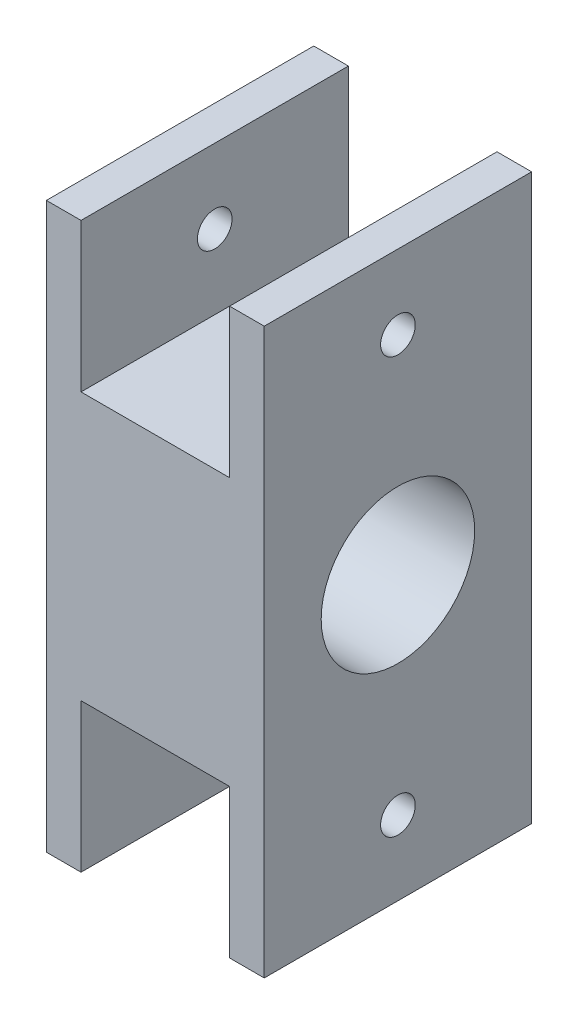
ISO-10303-21;
HEADER;
FILE_DESCRIPTION(('STEP AP214'),'2;1');
FILE_NAME('part.step','',(''),(''),'','','');
FILE_SCHEMA(('AUTOMOTIVE_DESIGN { 1 0 10303 214 1 1 1 1 }'));
ENDSEC;
DATA;
#1=APPLICATION_CONTEXT('core data for automotive mechanical design processes');
#2=APPLICATION_PROTOCOL_DEFINITION('international standard','automotive_design',2000,#1);
#3=PRODUCT_CONTEXT('',#1,'mechanical');
#4=PRODUCT('Part','Part','',(#3));
#5=PRODUCT_RELATED_PRODUCT_CATEGORY('part','',(#4));
#6=PRODUCT_DEFINITION_FORMATION('','',#4);
#7=PRODUCT_DEFINITION_CONTEXT('part definition',#1,'design');
#8=PRODUCT_DEFINITION('design','',#6,#7);
#9=PRODUCT_DEFINITION_SHAPE('','',#8);
#10=(LENGTH_UNIT() NAMED_UNIT(*) SI_UNIT(.MILLI.,.METRE.));
#11=(NAMED_UNIT(*) PLANE_ANGLE_UNIT() SI_UNIT($,.RADIAN.));
#12=(NAMED_UNIT(*) SI_UNIT($,.STERADIAN.) SOLID_ANGLE_UNIT());
#13=UNCERTAINTY_MEASURE_WITH_UNIT(LENGTH_MEASURE(1.E-05),#10,'distance_accuracy_value','');
#14=(GEOMETRIC_REPRESENTATION_CONTEXT(3) GLOBAL_UNCERTAINTY_ASSIGNED_CONTEXT((#13)) GLOBAL_UNIT_ASSIGNED_CONTEXT((#10,
#11,#12)) REPRESENTATION_CONTEXT('',''));
#15=CARTESIAN_POINT('',(0.,0.,0.));
#16=DIRECTION('',(0.,0.,1.));
#17=DIRECTION('',(1.,0.,0.));
#18=AXIS2_PLACEMENT_3D('',#15,#16,#17);
#19=CARTESIAN_POINT('',(-21.999999942,-56.999999919,53.99999995));
#20=DIRECTION('',(1.,0.,0.));
#21=DIRECTION('',(0.,0.,-1.));
#22=AXIS2_PLACEMENT_3D('',#19,#20,#21);
#23=PLANE('',#22);
#24=CARTESIAN_POINT('',(-21.999999942,0.,26.999999975));
#25=DIRECTION('',(-1.,0.,0.));
#26=DIRECTION('',(0.,0.,1.));
#27=AXIS2_PLACEMENT_3D('',#24,#25,#26);
#28=CIRCLE('',#27,20.000000005);
#29=CARTESIAN_POINT('',(-21.999999942,0.,46.99999998));
#30=VERTEX_POINT('',#29);
#31=EDGE_CURVE('E278',#30,#30,#28,.T.);
#32=ORIENTED_EDGE('',*,*,#31,.F.);
#33=EDGE_LOOP('',(#32));
#34=FACE_BOUND('',#33,.T.);
#35=CARTESIAN_POINT('',(-21.999999942,-41.999999947,26.999999975));
#36=DIRECTION('',(-1.,0.,0.));
#37=DIRECTION('',(0.,0.,1.));
#38=AXIS2_PLACEMENT_3D('',#35,#36,#37);
#39=CIRCLE('',#38,3.49999998500002);
#40=CARTESIAN_POINT('',(-21.999999942,-41.999999947,30.49999996));
#41=VERTEX_POINT('',#40);
#42=EDGE_CURVE('E282',#41,#41,#39,.T.);
#43=ORIENTED_EDGE('',*,*,#42,.F.);
#44=EDGE_LOOP('',(#43));
#45=FACE_BOUND('',#44,.T.);
#46=CARTESIAN_POINT('',(-21.999999942,41.999999947,26.999999975));
#47=DIRECTION('',(-1.,0.,0.));
#48=DIRECTION('',(0.,0.,1.));
#49=AXIS2_PLACEMENT_3D('',#46,#47,#48);
#50=CIRCLE('',#49,3.49999998500002);
#51=CARTESIAN_POINT('',(-21.999999942,41.999999947,30.49999996));
#52=VERTEX_POINT('',#51);
#53=EDGE_CURVE('E285',#52,#52,#50,.T.);
#54=ORIENTED_EDGE('',*,*,#53,.F.);
#55=EDGE_LOOP('',(#54));
#56=FACE_BOUND('',#55,.T.);
#57=DIRECTION('',(0.,-1.,0.));
#58=VECTOR('',#57,1.);
#59=CARTESIAN_POINT('',(-21.999999942,-56.999999919,0.));
#60=LINE('',#59,#58);
#61=CARTESIAN_POINT('',(-21.999999942,56.999999919,0.));
#62=VERTEX_POINT('',#61);
#63=CARTESIAN_POINT('',(-21.999999942,-56.999999919,0.));
#64=VERTEX_POINT('',#63);
#65=EDGE_CURVE('E164',#62,#64,#60,.T.);
#66=ORIENTED_EDGE('',*,*,#65,.T.);
#67=DIRECTION('',(0.,0.,-1.));
#68=VECTOR('',#67,1.);
#69=CARTESIAN_POINT('',(-21.999999942,-56.999999919,53.99999995));
#70=LINE('',#69,#68);
#71=CARTESIAN_POINT('',(-21.999999942,-56.999999919,53.99999995));
#72=VERTEX_POINT('',#71);
#73=EDGE_CURVE('E11',#72,#64,#70,.T.);
#74=ORIENTED_EDGE('',*,*,#73,.F.);
#75=DIRECTION('',(0.,-1.,0.));
#76=VECTOR('',#75,1.);
#77=CARTESIAN_POINT('',(-21.999999942,-56.999999919,53.99999995));
#78=LINE('',#77,#76);
#79=CARTESIAN_POINT('',(-21.999999942,56.999999919,53.99999995));
#80=VERTEX_POINT('',#79);
#81=EDGE_CURVE('E187',#80,#72,#78,.T.);
#82=ORIENTED_EDGE('',*,*,#81,.F.);
#83=DIRECTION('',(0.,0.,-1.));
#84=VECTOR('',#83,1.);
#85=CARTESIAN_POINT('',(-21.999999942,56.999999919,53.99999995));
#86=LINE('',#85,#84);
#87=EDGE_CURVE('E160',#80,#62,#86,.T.);
#88=ORIENTED_EDGE('',*,*,#87,.T.);
#89=EDGE_LOOP('',(#66,#74,#82,#88));
#90=FACE_BOUND('',#89,.T.);
#91=ADVANCED_FACE('F43',(#34,#45,#56,#90),#23,.F.);
#92=CARTESIAN_POINT('',(-14.999999972,-56.999999919,53.99999995));
#93=DIRECTION('',(0.,1.,0.));
#94=DIRECTION('',(0.,0.,1.));
#95=AXIS2_PLACEMENT_3D('',#92,#93,#94);
#96=PLANE('',#95);
#97=DIRECTION('',(1.,0.,0.));
#98=VECTOR('',#97,1.);
#99=CARTESIAN_POINT('',(-14.999999972,-56.999999919,0.));
#100=LINE('',#99,#98);
#101=CARTESIAN_POINT('',(-14.999999972,-56.999999919,0.));
#102=VERTEX_POINT('',#101);
#103=EDGE_CURVE('E167',#64,#102,#100,.T.);
#104=ORIENTED_EDGE('',*,*,#103,.T.);
#105=DIRECTION('',(0.,0.,-1.));
#106=VECTOR('',#105,1.);
#107=CARTESIAN_POINT('',(-14.999999972,-56.999999919,53.99999995));
#108=LINE('',#107,#106);
#109=CARTESIAN_POINT('',(-14.999999972,-56.999999919,53.99999995));
#110=VERTEX_POINT('',#109);
#111=EDGE_CURVE('E52',#110,#102,#108,.T.);
#112=ORIENTED_EDGE('',*,*,#111,.F.);
#113=DIRECTION('',(1.,0.,0.));
#114=VECTOR('',#113,1.);
#115=CARTESIAN_POINT('',(-14.999999972,-56.999999919,53.99999995));
#116=LINE('',#115,#114);
#117=EDGE_CURVE('E115',#72,#110,#116,.T.);
#118=ORIENTED_EDGE('',*,*,#117,.F.);
#119=ORIENTED_EDGE('',*,*,#73,.T.);
#120=EDGE_LOOP('',(#104,#112,#118,#119));
#121=FACE_BOUND('',#120,.T.);
#122=ADVANCED_FACE('F268',(#121),#96,.F.);
#123=CARTESIAN_POINT('',(-14.999999972,-26.999999975,53.99999995));
#124=DIRECTION('',(-1.,0.,0.));
#125=DIRECTION('',(0.,-1.,0.));
#126=AXIS2_PLACEMENT_3D('',#123,#124,#125);
#127=PLANE('',#126);
#128=CARTESIAN_POINT('',(-14.999999972,-41.999999947,26.999999975));
#129=DIRECTION('',(-1.,0.,0.));
#130=DIRECTION('',(0.,-1.,0.));
#131=AXIS2_PLACEMENT_3D('',#128,#129,#130);
#132=CIRCLE('',#131,3.49999998500001);
#133=CARTESIAN_POINT('',(-14.999999972,-45.499999932,26.999999975));
#134=VERTEX_POINT('',#133);
#135=EDGE_CURVE('E293',#134,#134,#132,.T.);
#136=ORIENTED_EDGE('',*,*,#135,.T.);
#137=EDGE_LOOP('',(#136));
#138=FACE_BOUND('',#137,.T.);
#139=DIRECTION('',(0.,1.,0.));
#140=VECTOR('',#139,1.);
#141=CARTESIAN_POINT('',(-14.999999972,-26.999999975,0.));
#142=LINE('',#141,#140);
#143=CARTESIAN_POINT('',(-14.999999972,-26.999999975,0.));
#144=VERTEX_POINT('',#143);
#145=EDGE_CURVE('E170',#102,#144,#142,.T.);
#146=ORIENTED_EDGE('',*,*,#145,.T.);
#147=DIRECTION('',(0.,0.,-1.));
#148=VECTOR('',#147,1.);
#149=CARTESIAN_POINT('',(-14.999999972,-26.999999975,53.99999995));
#150=LINE('',#149,#148);
#151=CARTESIAN_POINT('',(-14.999999972,-26.999999975,53.99999995));
#152=VERTEX_POINT('',#151);
#153=EDGE_CURVE('E206',#152,#144,#150,.T.);
#154=ORIENTED_EDGE('',*,*,#153,.F.);
#155=DIRECTION('',(0.,1.,0.));
#156=VECTOR('',#155,1.);
#157=CARTESIAN_POINT('',(-14.999999972,-26.999999975,53.99999995));
#158=LINE('',#157,#156);
#159=EDGE_CURVE('E215',#110,#152,#158,.T.);
#160=ORIENTED_EDGE('',*,*,#159,.F.);
#161=ORIENTED_EDGE('',*,*,#111,.T.);
#162=EDGE_LOOP('',(#146,#154,#160,#161));
#163=FACE_BOUND('',#162,.T.);
#164=ADVANCED_FACE('F213',(#138,#163),#127,.F.);
#165=CARTESIAN_POINT('',(14.999999972,-26.999999975,53.99999995));
#166=DIRECTION('',(0.,1.,0.));
#167=DIRECTION('',(0.,0.,1.));
#168=AXIS2_PLACEMENT_3D('',#165,#166,#167);
#169=PLANE('',#168);
#170=DIRECTION('',(1.,0.,0.));
#171=VECTOR('',#170,1.);
#172=CARTESIAN_POINT('',(14.999999972,-26.999999975,0.));
#173=LINE('',#172,#171);
#174=CARTESIAN_POINT('',(14.999999972,-26.999999975,0.));
#175=VERTEX_POINT('',#174);
#176=EDGE_CURVE('E172',#144,#175,#173,.T.);
#177=ORIENTED_EDGE('',*,*,#176,.T.);
#178=DIRECTION('',(0.,0.,-1.));
#179=VECTOR('',#178,1.);
#180=CARTESIAN_POINT('',(14.999999972,-26.999999975,53.99999995));
#181=LINE('',#180,#179);
#182=CARTESIAN_POINT('',(14.999999972,-26.999999975,53.99999995));
#183=VERTEX_POINT('',#182);
#184=EDGE_CURVE('E203',#183,#175,#181,.T.);
#185=ORIENTED_EDGE('',*,*,#184,.F.);
#186=DIRECTION('',(1.,0.,0.));
#187=VECTOR('',#186,1.);
#188=CARTESIAN_POINT('',(14.999999972,-26.999999975,53.99999995));
#189=LINE('',#188,#187);
#190=EDGE_CURVE('E233',#152,#183,#189,.T.);
#191=ORIENTED_EDGE('',*,*,#190,.F.);
#192=ORIENTED_EDGE('',*,*,#153,.T.);
#193=EDGE_LOOP('',(#177,#185,#191,#192));
#194=FACE_BOUND('',#193,.T.);
#195=ADVANCED_FACE('F224',(#194),#169,.F.);
#196=CARTESIAN_POINT('',(14.999999972,-56.999999919,53.99999995));
#197=DIRECTION('',(1.,0.,0.));
#198=DIRECTION('',(0.,1.,0.));
#199=AXIS2_PLACEMENT_3D('',#196,#197,#198);
#200=PLANE('',#199);
#201=CARTESIAN_POINT('',(14.999999972,-41.999999947,26.999999975));
#202=DIRECTION('',(1.,0.,0.));
#203=DIRECTION('',(0.,1.,0.));
#204=AXIS2_PLACEMENT_3D('',#201,#202,#203);
#205=CIRCLE('',#204,3.49999998500001);
#206=CARTESIAN_POINT('',(14.999999972,-38.499999962,26.999999975));
#207=VERTEX_POINT('',#206);
#208=EDGE_CURVE('E288',#207,#207,#205,.T.);
#209=ORIENTED_EDGE('',*,*,#208,.T.);
#210=EDGE_LOOP('',(#209));
#211=FACE_BOUND('',#210,.T.);
#212=DIRECTION('',(0.,-1.,0.));
#213=VECTOR('',#212,1.);
#214=CARTESIAN_POINT('',(14.999999972,-56.999999919,0.));
#215=LINE('',#214,#213);
#216=CARTESIAN_POINT('',(14.999999972,-56.999999919,0.));
#217=VERTEX_POINT('',#216);
#218=EDGE_CURVE('E174',#175,#217,#215,.T.);
#219=ORIENTED_EDGE('',*,*,#218,.T.);
#220=DIRECTION('',(0.,0.,-1.));
#221=VECTOR('',#220,1.);
#222=CARTESIAN_POINT('',(14.999999972,-56.999999919,53.99999995));
#223=LINE('',#222,#221);
#224=CARTESIAN_POINT('',(14.999999972,-56.999999919,53.99999995));
#225=VERTEX_POINT('',#224);
#226=EDGE_CURVE('E200',#225,#217,#223,.T.);
#227=ORIENTED_EDGE('',*,*,#226,.F.);
#228=DIRECTION('',(0.,-1.,0.));
#229=VECTOR('',#228,1.);
#230=CARTESIAN_POINT('',(14.999999972,-56.999999919,53.99999995));
#231=LINE('',#230,#229);
#232=EDGE_CURVE('E230',#183,#225,#231,.T.);
#233=ORIENTED_EDGE('',*,*,#232,.F.);
#234=ORIENTED_EDGE('',*,*,#184,.T.);
#235=EDGE_LOOP('',(#219,#227,#233,#234));
#236=FACE_BOUND('',#235,.T.);
#237=ADVANCED_FACE('F228',(#211,#236),#200,.F.);
#238=CARTESIAN_POINT('',(21.999999942,-56.999999919,53.99999995));
#239=DIRECTION('',(0.,1.,0.));
#240=DIRECTION('',(0.,0.,1.));
#241=AXIS2_PLACEMENT_3D('',#238,#239,#240);
#242=PLANE('',#241);
#243=DIRECTION('',(1.,0.,0.));
#244=VECTOR('',#243,1.);
#245=CARTESIAN_POINT('',(21.999999942,-56.999999919,0.));
#246=LINE('',#245,#244);
#247=CARTESIAN_POINT('',(21.999999942,-56.999999919,0.));
#248=VERTEX_POINT('',#247);
#249=EDGE_CURVE('E176',#217,#248,#246,.T.);
#250=ORIENTED_EDGE('',*,*,#249,.T.);
#251=DIRECTION('',(0.,0.,-1.));
#252=VECTOR('',#251,1.);
#253=CARTESIAN_POINT('',(21.999999942,-56.999999919,53.99999995));
#254=LINE('',#253,#252);
#255=CARTESIAN_POINT('',(21.999999942,-56.999999919,53.99999995));
#256=VERTEX_POINT('',#255);
#257=EDGE_CURVE('E197',#256,#248,#254,.T.);
#258=ORIENTED_EDGE('',*,*,#257,.F.);
#259=DIRECTION('',(1.,0.,0.));
#260=VECTOR('',#259,1.);
#261=CARTESIAN_POINT('',(21.999999942,-56.999999919,53.99999995));
#262=LINE('',#261,#260);
#263=EDGE_CURVE('E232',#225,#256,#262,.T.);
#264=ORIENTED_EDGE('',*,*,#263,.F.);
#265=ORIENTED_EDGE('',*,*,#226,.T.);
#266=EDGE_LOOP('',(#250,#258,#264,#265));
#267=FACE_BOUND('',#266,.T.);
#268=ADVANCED_FACE('F387',(#267),#242,.F.);
#269=CARTESIAN_POINT('',(21.999999942,56.999999919,53.99999995));
#270=DIRECTION('',(-1.,0.,0.));
#271=DIRECTION('',(0.,0.,1.));
#272=AXIS2_PLACEMENT_3D('',#269,#270,#271);
#273=PLANE('',#272);
#274=CARTESIAN_POINT('',(21.999999942,0.,26.999999975));
#275=DIRECTION('',(-1.,0.,0.));
#276=DIRECTION('',(0.,0.,1.));
#277=AXIS2_PLACEMENT_3D('',#274,#275,#276);
#278=CIRCLE('',#277,15.499999988);
#279=CARTESIAN_POINT('',(21.999999942,0.,42.499999963));
#280=VERTEX_POINT('',#279);
#281=EDGE_CURVE('E343',#280,#280,#278,.T.);
#282=ORIENTED_EDGE('',*,*,#281,.T.);
#283=EDGE_LOOP('',(#282));
#284=FACE_BOUND('',#283,.T.);
#285=CARTESIAN_POINT('',(21.999999942,-41.999999947,26.999999975));
#286=DIRECTION('',(-1.,0.,0.));
#287=DIRECTION('',(0.,0.,1.));
#288=AXIS2_PLACEMENT_3D('',#285,#286,#287);
#289=CIRCLE('',#288,3.49999998500001);
#290=CARTESIAN_POINT('',(21.999999942,-41.999999947,30.49999996));
#291=VERTEX_POINT('',#290);
#292=EDGE_CURVE('E347',#291,#291,#289,.T.);
#293=ORIENTED_EDGE('',*,*,#292,.T.);
#294=EDGE_LOOP('',(#293));
#295=FACE_BOUND('',#294,.T.);
#296=CARTESIAN_POINT('',(21.999999942,41.999999947,26.999999975));
#297=DIRECTION('',(-1.,0.,0.));
#298=DIRECTION('',(0.,0.,1.));
#299=AXIS2_PLACEMENT_3D('',#296,#297,#298);
#300=CIRCLE('',#299,3.49999998500001);
#301=CARTESIAN_POINT('',(21.999999942,41.999999947,30.49999996));
#302=VERTEX_POINT('',#301);
#303=EDGE_CURVE('E287',#302,#302,#300,.T.);
#304=ORIENTED_EDGE('',*,*,#303,.T.);
#305=EDGE_LOOP('',(#304));
#306=FACE_BOUND('',#305,.T.);
#307=DIRECTION('',(0.,1.,0.));
#308=VECTOR('',#307,1.);
#309=CARTESIAN_POINT('',(21.999999942,56.999999919,0.));
#310=LINE('',#309,#308);
#311=CARTESIAN_POINT('',(21.999999942,56.999999919,0.));
#312=VERTEX_POINT('',#311);
#313=EDGE_CURVE('E178',#248,#312,#310,.T.);
#314=ORIENTED_EDGE('',*,*,#313,.T.);
#315=DIRECTION('',(0.,0.,-1.));
#316=VECTOR('',#315,1.);
#317=CARTESIAN_POINT('',(21.999999942,56.999999919,53.99999995));
#318=LINE('',#317,#316);
#319=CARTESIAN_POINT('',(21.999999942,56.999999919,53.99999995));
#320=VERTEX_POINT('',#319);
#321=EDGE_CURVE('E194',#320,#312,#318,.T.);
#322=ORIENTED_EDGE('',*,*,#321,.F.);
#323=DIRECTION('',(0.,1.,0.));
#324=VECTOR('',#323,1.);
#325=CARTESIAN_POINT('',(21.999999942,56.999999919,53.99999995));
#326=LINE('',#325,#324);
#327=EDGE_CURVE('E235',#256,#320,#326,.T.);
#328=ORIENTED_EDGE('',*,*,#327,.F.);
#329=ORIENTED_EDGE('',*,*,#257,.T.);
#330=EDGE_LOOP('',(#314,#322,#328,#329));
#331=FACE_BOUND('',#330,.T.);
#332=ADVANCED_FACE('F384',(#284,#295,#306,#331),#273,.F.);
#333=CARTESIAN_POINT('',(14.999999972,56.999999919,53.99999995));
#334=DIRECTION('',(0.,-1.,0.));
#335=DIRECTION('',(0.,0.,-1.));
#336=AXIS2_PLACEMENT_3D('',#333,#334,#335);
#337=PLANE('',#336);
#338=DIRECTION('',(-1.,0.,0.));
#339=VECTOR('',#338,1.);
#340=CARTESIAN_POINT('',(14.999999972,56.999999919,0.));
#341=LINE('',#340,#339);
#342=CARTESIAN_POINT('',(14.999999972,56.999999919,0.));
#343=VERTEX_POINT('',#342);
#344=EDGE_CURVE('E180',#312,#343,#341,.T.);
#345=ORIENTED_EDGE('',*,*,#344,.T.);
#346=DIRECTION('',(0.,0.,-1.));
#347=VECTOR('',#346,1.);
#348=CARTESIAN_POINT('',(14.999999972,56.999999919,53.99999995));
#349=LINE('',#348,#347);
#350=CARTESIAN_POINT('',(14.999999972,56.999999919,53.99999995));
#351=VERTEX_POINT('',#350);
#352=EDGE_CURVE('E191',#351,#343,#349,.T.);
#353=ORIENTED_EDGE('',*,*,#352,.F.);
#354=DIRECTION('',(-1.,0.,0.));
#355=VECTOR('',#354,1.);
#356=CARTESIAN_POINT('',(14.999999972,56.999999919,53.99999995));
#357=LINE('',#356,#355);
#358=EDGE_CURVE('E241',#320,#351,#357,.T.);
#359=ORIENTED_EDGE('',*,*,#358,.F.);
#360=ORIENTED_EDGE('',*,*,#321,.T.);
#361=EDGE_LOOP('',(#345,#353,#359,#360));
#362=FACE_BOUND('',#361,.T.);
#363=ADVANCED_FACE('F247',(#362),#337,.F.);
#364=CARTESIAN_POINT('',(14.999999972,26.999999975,53.99999995));
#365=DIRECTION('',(1.,0.,0.));
#366=DIRECTION('',(0.,1.,0.));
#367=AXIS2_PLACEMENT_3D('',#364,#365,#366);
#368=PLANE('',#367);
#369=CARTESIAN_POINT('',(14.999999972,41.999999947,26.999999975));
#370=DIRECTION('',(1.,0.,0.));
#371=DIRECTION('',(0.,1.,0.));
#372=AXIS2_PLACEMENT_3D('',#369,#370,#371);
#373=CIRCLE('',#372,3.49999998500001);
#374=CARTESIAN_POINT('',(14.999999972,45.499999932,26.999999975));
#375=VERTEX_POINT('',#374);
#376=EDGE_CURVE('E46',#375,#375,#373,.T.);
#377=ORIENTED_EDGE('',*,*,#376,.T.);
#378=EDGE_LOOP('',(#377));
#379=FACE_BOUND('',#378,.T.);
#380=DIRECTION('',(0.,-1.,0.));
#381=VECTOR('',#380,1.);
#382=CARTESIAN_POINT('',(14.999999972,26.999999975,0.));
#383=LINE('',#382,#381);
#384=CARTESIAN_POINT('',(14.999999972,26.999999975,0.));
#385=VERTEX_POINT('',#384);
#386=EDGE_CURVE('E182',#343,#385,#383,.T.);
#387=ORIENTED_EDGE('',*,*,#386,.T.);
#388=DIRECTION('',(0.,0.,-1.));
#389=VECTOR('',#388,1.);
#390=CARTESIAN_POINT('',(14.999999972,26.999999975,53.99999995));
#391=LINE('',#390,#389);
#392=CARTESIAN_POINT('',(14.999999972,26.999999975,53.99999995));
#393=VERTEX_POINT('',#392);
#394=EDGE_CURVE('E155',#393,#385,#391,.T.);
#395=ORIENTED_EDGE('',*,*,#394,.F.);
#396=DIRECTION('',(0.,-1.,0.));
#397=VECTOR('',#396,1.);
#398=CARTESIAN_POINT('',(14.999999972,26.999999975,53.99999995));
#399=LINE('',#398,#397);
#400=EDGE_CURVE('E146',#351,#393,#399,.T.);
#401=ORIENTED_EDGE('',*,*,#400,.F.);
#402=ORIENTED_EDGE('',*,*,#352,.T.);
#403=EDGE_LOOP('',(#387,#395,#401,#402));
#404=FACE_BOUND('',#403,.T.);
#405=ADVANCED_FACE('F251',(#379,#404),#368,.F.);
#406=CARTESIAN_POINT('',(-14.999999972,26.999999975,53.99999995));
#407=DIRECTION('',(0.,-1.,0.));
#408=DIRECTION('',(0.,0.,-1.));
#409=AXIS2_PLACEMENT_3D('',#406,#407,#408);
#410=PLANE('',#409);
#411=DIRECTION('',(-1.,0.,0.));
#412=VECTOR('',#411,1.);
#413=CARTESIAN_POINT('',(-14.999999972,26.999999975,0.));
#414=LINE('',#413,#412);
#415=CARTESIAN_POINT('',(-14.999999972,26.999999975,0.));
#416=VERTEX_POINT('',#415);
#417=EDGE_CURVE('E154',#385,#416,#414,.T.);
#418=ORIENTED_EDGE('',*,*,#417,.T.);
#419=DIRECTION('',(0.,0.,-1.));
#420=VECTOR('',#419,1.);
#421=CARTESIAN_POINT('',(-14.999999972,26.999999975,53.99999995));
#422=LINE('',#421,#420);
#423=CARTESIAN_POINT('',(-14.999999972,26.999999975,53.99999995));
#424=VERTEX_POINT('',#423);
#425=EDGE_CURVE('E151',#424,#416,#422,.T.);
#426=ORIENTED_EDGE('',*,*,#425,.F.);
#427=DIRECTION('',(-1.,0.,0.));
#428=VECTOR('',#427,1.);
#429=CARTESIAN_POINT('',(-14.999999972,26.999999975,53.99999995));
#430=LINE('',#429,#428);
#431=EDGE_CURVE('E140',#393,#424,#430,.T.);
#432=ORIENTED_EDGE('',*,*,#431,.F.);
#433=ORIENTED_EDGE('',*,*,#394,.T.);
#434=EDGE_LOOP('',(#418,#426,#432,#433));
#435=FACE_BOUND('',#434,.T.);
#436=ADVANCED_FACE('F152',(#435),#410,.F.);
#437=CARTESIAN_POINT('',(-14.999999972,56.999999919,53.99999995));
#438=DIRECTION('',(-1.,0.,0.));
#439=DIRECTION('',(0.,-1.,0.));
#440=AXIS2_PLACEMENT_3D('',#437,#438,#439);
#441=PLANE('',#440);
#442=CARTESIAN_POINT('',(-14.999999972,41.999999947,26.999999975));
#443=DIRECTION('',(-1.,0.,0.));
#444=DIRECTION('',(0.,-1.,0.));
#445=AXIS2_PLACEMENT_3D('',#442,#443,#444);
#446=CIRCLE('',#445,3.49999998500001);
#447=CARTESIAN_POINT('',(-14.999999972,38.499999962,26.999999975));
#448=VERTEX_POINT('',#447);
#449=EDGE_CURVE('E168',#448,#448,#446,.T.);
#450=ORIENTED_EDGE('',*,*,#449,.T.);
#451=EDGE_LOOP('',(#450));
#452=FACE_BOUND('',#451,.T.);
#453=DIRECTION('',(0.,1.,0.));
#454=VECTOR('',#453,1.);
#455=CARTESIAN_POINT('',(-14.999999972,56.999999919,0.));
#456=LINE('',#455,#454);
#457=CARTESIAN_POINT('',(-14.999999972,56.999999919,0.));
#458=VERTEX_POINT('',#457);
#459=EDGE_CURVE('E101',#416,#458,#456,.T.);
#460=ORIENTED_EDGE('',*,*,#459,.T.);
#461=DIRECTION('',(0.,0.,-1.));
#462=VECTOR('',#461,1.);
#463=CARTESIAN_POINT('',(-14.999999972,56.999999919,53.99999995));
#464=LINE('',#463,#462);
#465=CARTESIAN_POINT('',(-14.999999972,56.999999919,53.99999995));
#466=VERTEX_POINT('',#465);
#467=EDGE_CURVE('E156',#466,#458,#464,.T.);
#468=ORIENTED_EDGE('',*,*,#467,.F.);
#469=DIRECTION('',(0.,1.,0.));
#470=VECTOR('',#469,1.);
#471=CARTESIAN_POINT('',(-14.999999972,56.999999919,53.99999995));
#472=LINE('',#471,#470);
#473=EDGE_CURVE('E144',#424,#466,#472,.T.);
#474=ORIENTED_EDGE('',*,*,#473,.F.);
#475=ORIENTED_EDGE('',*,*,#425,.T.);
#476=EDGE_LOOP('',(#460,#468,#474,#475));
#477=FACE_BOUND('',#476,.T.);
#478=ADVANCED_FACE('F158',(#452,#477),#441,.F.);
#479=CARTESIAN_POINT('',(-21.999999942,56.999999919,53.99999995));
#480=DIRECTION('',(0.,-1.,0.));
#481=DIRECTION('',(0.,0.,-1.));
#482=AXIS2_PLACEMENT_3D('',#479,#480,#481);
#483=PLANE('',#482);
#484=DIRECTION('',(-1.,0.,0.));
#485=VECTOR('',#484,1.);
#486=CARTESIAN_POINT('',(-21.999999942,56.999999919,0.));
#487=LINE('',#486,#485);
#488=EDGE_CURVE('E107',#458,#62,#487,.T.);
#489=ORIENTED_EDGE('',*,*,#488,.T.);
#490=ORIENTED_EDGE('',*,*,#87,.F.);
#491=DIRECTION('',(-1.,0.,0.));
#492=VECTOR('',#491,1.);
#493=CARTESIAN_POINT('',(-21.999999942,56.999999919,53.99999995));
#494=LINE('',#493,#492);
#495=EDGE_CURVE('E60',#466,#80,#494,.T.);
#496=ORIENTED_EDGE('',*,*,#495,.F.);
#497=ORIENTED_EDGE('',*,*,#467,.T.);
#498=EDGE_LOOP('',(#489,#490,#496,#497));
#499=FACE_BOUND('',#498,.T.);
#500=ADVANCED_FACE('F255',(#499),#483,.F.);
#501=CARTESIAN_POINT('',(0.,0.,53.99999995));
#502=DIRECTION('',(0.,0.,-1.));
#503=DIRECTION('',(-1.,0.,0.));
#504=AXIS2_PLACEMENT_3D('',#501,#502,#503);
#505=PLANE('',#504);
#506=ORIENTED_EDGE('',*,*,#81,.T.);
#507=ORIENTED_EDGE('',*,*,#117,.T.);
#508=ORIENTED_EDGE('',*,*,#159,.T.);
#509=ORIENTED_EDGE('',*,*,#190,.T.);
#510=ORIENTED_EDGE('',*,*,#232,.T.);
#511=ORIENTED_EDGE('',*,*,#263,.T.);
#512=ORIENTED_EDGE('',*,*,#327,.T.);
#513=ORIENTED_EDGE('',*,*,#358,.T.);
#514=ORIENTED_EDGE('',*,*,#400,.T.);
#515=ORIENTED_EDGE('',*,*,#431,.T.);
#516=ORIENTED_EDGE('',*,*,#473,.T.);
#517=ORIENTED_EDGE('',*,*,#495,.T.);
#518=EDGE_LOOP('',(#506,#507,#508,#509,#510,#511,#512,#513,#514,#515,#516,#517));
#519=FACE_BOUND('',#518,.T.);
#520=ADVANCED_FACE('F142',(#519),#505,.F.);
#521=CARTESIAN_POINT('',(0.,0.,0.));
#522=DIRECTION('',(0.,0.,-1.));
#523=DIRECTION('',(-1.,0.,0.));
#524=AXIS2_PLACEMENT_3D('',#521,#522,#523);
#525=PLANE('',#524);
#526=ORIENTED_EDGE('',*,*,#65,.F.);
#527=ORIENTED_EDGE('',*,*,#488,.F.);
#528=ORIENTED_EDGE('',*,*,#459,.F.);
#529=ORIENTED_EDGE('',*,*,#417,.F.);
#530=ORIENTED_EDGE('',*,*,#386,.F.);
#531=ORIENTED_EDGE('',*,*,#344,.F.);
#532=ORIENTED_EDGE('',*,*,#313,.F.);
#533=ORIENTED_EDGE('',*,*,#249,.F.);
#534=ORIENTED_EDGE('',*,*,#218,.F.);
#535=ORIENTED_EDGE('',*,*,#176,.F.);
#536=ORIENTED_EDGE('',*,*,#145,.F.);
#537=ORIENTED_EDGE('',*,*,#103,.F.);
#538=EDGE_LOOP('',(#526,#527,#528,#529,#530,#531,#532,#533,#534,#535,#536,#537));
#539=FACE_BOUND('',#538,.T.);
#540=ADVANCED_FACE('F219',(#539),#525,.T.);
#541=CARTESIAN_POINT('',(-21.999999942,41.999999947,26.999999975));
#542=DIRECTION('',(-1.,0.,0.));
#543=DIRECTION('',(0.,0.,1.));
#544=AXIS2_PLACEMENT_3D('',#541,#542,#543);
#545=CYLINDRICAL_SURFACE('',#544,3.49999998500001);
#546=ORIENTED_EDGE('',*,*,#303,.F.);
#547=EDGE_LOOP('',(#546));
#548=FACE_BOUND('',#547,.T.);
#549=ORIENTED_EDGE('',*,*,#376,.F.);
#550=EDGE_LOOP('',(#549));
#551=FACE_BOUND('',#550,.T.);
#552=ADVANCED_FACE('F305',(#548,#551),#545,.F.);
#553=ORIENTED_EDGE('',*,*,#53,.T.);
#554=EDGE_LOOP('',(#553));
#555=FACE_BOUND('',#554,.T.);
#556=ORIENTED_EDGE('',*,*,#449,.F.);
#557=EDGE_LOOP('',(#556));
#558=FACE_BOUND('',#557,.T.);
#559=ADVANCED_FACE('F307',(#555,#558),#545,.F.);
#560=CARTESIAN_POINT('',(-21.999999942,-41.999999947,26.999999975));
#561=DIRECTION('',(-1.,0.,0.));
#562=DIRECTION('',(0.,0.,1.));
#563=AXIS2_PLACEMENT_3D('',#560,#561,#562);
#564=CYLINDRICAL_SURFACE('',#563,3.49999998500001);
#565=ORIENTED_EDGE('',*,*,#42,.T.);
#566=EDGE_LOOP('',(#565));
#567=FACE_BOUND('',#566,.T.);
#568=ORIENTED_EDGE('',*,*,#135,.F.);
#569=EDGE_LOOP('',(#568));
#570=FACE_BOUND('',#569,.T.);
#571=ADVANCED_FACE('F313',(#567,#570),#564,.F.);
#572=ORIENTED_EDGE('',*,*,#292,.F.);
#573=EDGE_LOOP('',(#572));
#574=FACE_BOUND('',#573,.T.);
#575=ORIENTED_EDGE('',*,*,#208,.F.);
#576=EDGE_LOOP('',(#575));
#577=FACE_BOUND('',#576,.T.);
#578=ADVANCED_FACE('F317',(#574,#577),#564,.F.);
#579=CARTESIAN_POINT('',(-21.999999942,0.,26.999999975));
#580=DIRECTION('',(-1.,0.,0.));
#581=DIRECTION('',(0.,0.,1.));
#582=AXIS2_PLACEMENT_3D('',#579,#580,#581);
#583=CYLINDRICAL_SURFACE('',#582,15.499999988);
#584=ORIENTED_EDGE('',*,*,#281,.F.);
#585=EDGE_LOOP('',(#584));
#586=FACE_BOUND('',#585,.T.);
#587=CARTESIAN_POINT('',(-10.000000066,0.,26.999999975));
#588=DIRECTION('',(-1.,0.,0.));
#589=DIRECTION('',(0.,0.,1.));
#590=AXIS2_PLACEMENT_3D('',#587,#588,#589);
#591=CIRCLE('',#590,15.499999988);
#592=CARTESIAN_POINT('',(-10.000000066,0.,42.499999963));
#593=VERTEX_POINT('',#592);
#594=EDGE_CURVE('E338',#593,#593,#591,.T.);
#595=ORIENTED_EDGE('',*,*,#594,.T.);
#596=EDGE_LOOP('',(#595));
#597=FACE_BOUND('',#596,.T.);
#598=ADVANCED_FACE('F319',(#586,#597),#583,.F.);
#599=CARTESIAN_POINT('',(-10.000000066,15.499999988,26.999999975));
#600=DIRECTION('',(1.,0.,0.));
#601=DIRECTION('',(0.,0.,-1.));
#602=AXIS2_PLACEMENT_3D('',#599,#600,#601);
#603=PLANE('',#602);
#604=ORIENTED_EDGE('',*,*,#594,.F.);
#605=EDGE_LOOP('',(#604));
#606=FACE_BOUND('',#605,.T.);
#607=CARTESIAN_POINT('',(-10.000000066,0.,26.999999975));
#608=DIRECTION('',(-1.,0.,0.));
#609=DIRECTION('',(0.,0.,1.));
#610=AXIS2_PLACEMENT_3D('',#607,#608,#609);
#611=CIRCLE('',#610,20.000000005);
#612=CARTESIAN_POINT('',(-10.000000066,0.,46.99999998));
#613=VERTEX_POINT('',#612);
#614=EDGE_CURVE('E336',#613,#613,#611,.T.);
#615=ORIENTED_EDGE('',*,*,#614,.T.);
#616=EDGE_LOOP('',(#615));
#617=FACE_BOUND('',#616,.T.);
#618=ADVANCED_FACE('F323',(#606,#617),#603,.F.);
#619=CARTESIAN_POINT('',(-21.999999942,0.,26.999999975));
#620=DIRECTION('',(-1.,0.,0.));
#621=DIRECTION('',(0.,0.,1.));
#622=AXIS2_PLACEMENT_3D('',#619,#620,#621);
#623=CYLINDRICAL_SURFACE('',#622,20.000000005);
#624=ORIENTED_EDGE('',*,*,#614,.F.);
#625=EDGE_LOOP('',(#624));
#626=FACE_BOUND('',#625,.T.);
#627=ORIENTED_EDGE('',*,*,#31,.T.);
#628=EDGE_LOOP('',(#627));
#629=FACE_BOUND('',#628,.T.);
#630=ADVANCED_FACE('F327',(#626,#629),#623,.F.);
#631=CLOSED_SHELL('',(#91,#122,#164,#195,#237,#268,#332,#363,#405,#436,#478,#500,#520,#540,#552,
#559,#571,#578,#598,#618,#630));
#632=MANIFOLD_SOLID_BREP('B2',#631);
#633=ADVANCED_BREP_SHAPE_REPRESENTATION('',(#18,#632),#14);
#634=SHAPE_DEFINITION_REPRESENTATION(#9,#633);
ENDSEC;
END-ISO-10303-21;
